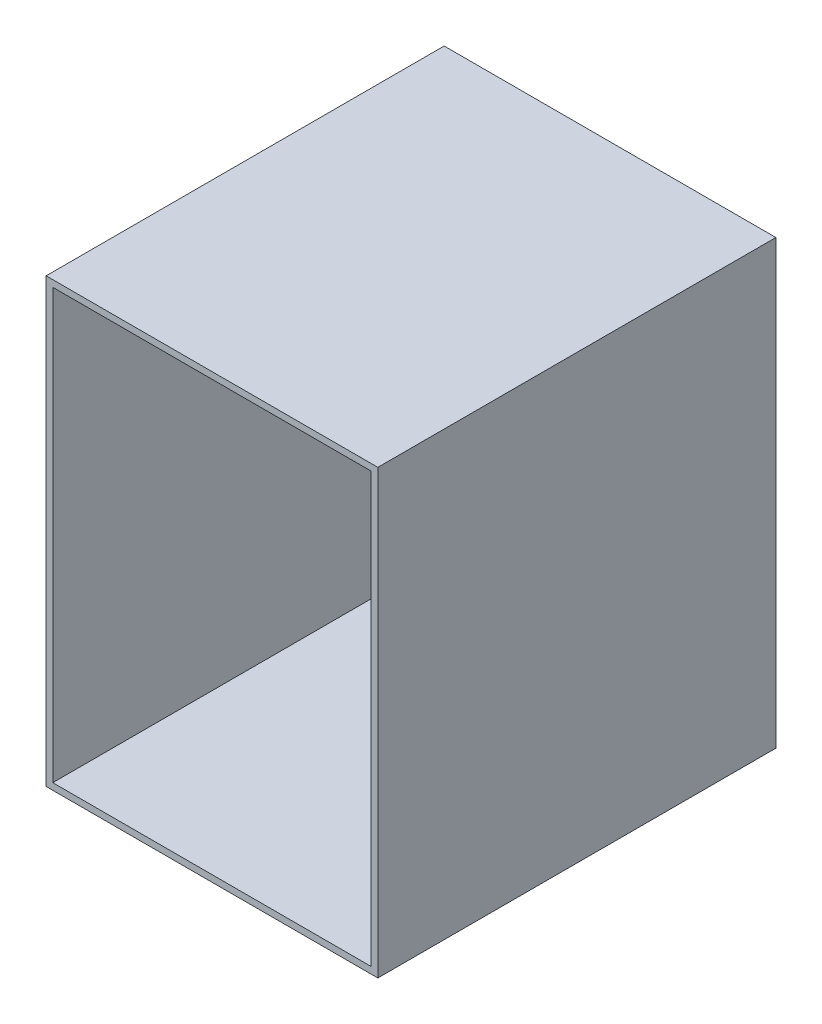
ISO-10303-21;
HEADER;
FILE_DESCRIPTION(('STEP AP214'),'2;1');
FILE_NAME('part.step','',(''),(''),'','','');
FILE_SCHEMA(('AUTOMOTIVE_DESIGN { 1 0 10303 214 1 1 1 1 }'));
ENDSEC;
DATA;
#1=APPLICATION_CONTEXT('core data for automotive mechanical design processes');
#2=APPLICATION_PROTOCOL_DEFINITION('international standard','automotive_design',2000,#1);
#3=PRODUCT_CONTEXT('',#1,'mechanical');
#4=PRODUCT('Part','Part','',(#3));
#5=PRODUCT_RELATED_PRODUCT_CATEGORY('part','',(#4));
#6=PRODUCT_DEFINITION_FORMATION('','',#4);
#7=PRODUCT_DEFINITION_CONTEXT('part definition',#1,'design');
#8=PRODUCT_DEFINITION('design','',#6,#7);
#9=PRODUCT_DEFINITION_SHAPE('','',#8);
#10=(LENGTH_UNIT() NAMED_UNIT(*) SI_UNIT(.MILLI.,.METRE.));
#11=(NAMED_UNIT(*) PLANE_ANGLE_UNIT() SI_UNIT($,.RADIAN.));
#12=(NAMED_UNIT(*) SI_UNIT($,.STERADIAN.) SOLID_ANGLE_UNIT());
#13=UNCERTAINTY_MEASURE_WITH_UNIT(LENGTH_MEASURE(1.E-05),#10,'distance_accuracy_value','');
#14=(GEOMETRIC_REPRESENTATION_CONTEXT(3) GLOBAL_UNCERTAINTY_ASSIGNED_CONTEXT((#13)) GLOBAL_UNIT_ASSIGNED_CONTEXT((#10,
#11,#12)) REPRESENTATION_CONTEXT('',''));
#15=CARTESIAN_POINT('',(0.,0.,0.));
#16=DIRECTION('',(0.,0.,1.));
#17=DIRECTION('',(1.,0.,0.));
#18=AXIS2_PLACEMENT_3D('',#15,#16,#17);
#19=CARTESIAN_POINT('',(-75.,100.,180.));
#20=DIRECTION('',(1.,0.,0.));
#21=DIRECTION('',(0.,1.,0.));
#22=AXIS2_PLACEMENT_3D('',#19,#20,#21);
#23=PLANE('',#22);
#24=DIRECTION('',(0.,-1.,0.));
#25=VECTOR('',#24,1.);
#26=CARTESIAN_POINT('',(-75.,100.,0.));
#27=LINE('',#26,#25);
#28=CARTESIAN_POINT('',(-75.,100.,0.));
#29=VERTEX_POINT('',#28);
#30=CARTESIAN_POINT('',(-75.,-100.,0.));
#31=VERTEX_POINT('',#30);
#32=EDGE_CURVE('E156',#29,#31,#27,.T.);
#33=ORIENTED_EDGE('',*,*,#32,.T.);
#34=DIRECTION('',(0.,0.,-1.));
#35=VECTOR('',#34,1.);
#36=CARTESIAN_POINT('',(-75.,-100.,180.));
#37=LINE('',#36,#35);
#38=CARTESIAN_POINT('',(-75.,-100.,180.));
#39=VERTEX_POINT('',#38);
#40=EDGE_CURVE('E12',#39,#31,#37,.T.);
#41=ORIENTED_EDGE('',*,*,#40,.F.);
#42=DIRECTION('',(0.,-1.,0.));
#43=VECTOR('',#42,1.);
#44=CARTESIAN_POINT('',(-75.,100.,180.));
#45=LINE('',#44,#43);
#46=CARTESIAN_POINT('',(-75.,100.,180.));
#47=VERTEX_POINT('',#46);
#48=EDGE_CURVE('E158',#47,#39,#45,.T.);
#49=ORIENTED_EDGE('',*,*,#48,.F.);
#50=DIRECTION('',(0.,0.,-1.));
#51=VECTOR('',#50,1.);
#52=CARTESIAN_POINT('',(-75.,100.,180.));
#53=LINE('',#52,#51);
#54=EDGE_CURVE('E65',#47,#29,#53,.T.);
#55=ORIENTED_EDGE('',*,*,#54,.T.);
#56=EDGE_LOOP('',(#33,#41,#49,#55));
#57=FACE_BOUND('',#56,.T.);
#58=ADVANCED_FACE('F41',(#57),#23,.F.);
#59=CARTESIAN_POINT('',(-75.,-100.,180.));
#60=DIRECTION('',(0.,1.,0.));
#61=DIRECTION('',(0.,0.,1.));
#62=AXIS2_PLACEMENT_3D('',#59,#60,#61);
#63=PLANE('',#62);
#64=DIRECTION('',(1.,0.,0.));
#65=VECTOR('',#64,1.);
#66=CARTESIAN_POINT('',(-75.,-100.,0.));
#67=LINE('',#66,#65);
#68=CARTESIAN_POINT('',(75.,-100.,0.));
#69=VERTEX_POINT('',#68);
#70=EDGE_CURVE('E173',#31,#69,#67,.T.);
#71=ORIENTED_EDGE('',*,*,#70,.T.);
#72=DIRECTION('',(0.,0.,-1.));
#73=VECTOR('',#72,1.);
#74=CARTESIAN_POINT('',(75.,-100.,180.));
#75=LINE('',#74,#73);
#76=CARTESIAN_POINT('',(75.,-100.,180.));
#77=VERTEX_POINT('',#76);
#78=EDGE_CURVE('E49',#77,#69,#75,.T.);
#79=ORIENTED_EDGE('',*,*,#78,.F.);
#80=DIRECTION('',(1.,0.,0.));
#81=VECTOR('',#80,1.);
#82=CARTESIAN_POINT('',(-75.,-100.,180.));
#83=LINE('',#82,#81);
#84=EDGE_CURVE('E91',#39,#77,#83,.T.);
#85=ORIENTED_EDGE('',*,*,#84,.F.);
#86=ORIENTED_EDGE('',*,*,#40,.T.);
#87=EDGE_LOOP('',(#71,#79,#85,#86));
#88=FACE_BOUND('',#87,.T.);
#89=ADVANCED_FACE('F193',(#88),#63,.F.);
#90=CARTESIAN_POINT('',(75.,100.,180.));
#91=DIRECTION('',(1.,0.,0.));
#92=DIRECTION('',(0.,1.,0.));
#93=AXIS2_PLACEMENT_3D('',#90,#91,#92);
#94=PLANE('',#93);
#95=DIRECTION('',(0.,-1.,0.));
#96=VECTOR('',#95,1.);
#97=CARTESIAN_POINT('',(75.,100.,0.));
#98=LINE('',#97,#96);
#99=CARTESIAN_POINT('',(75.,100.,0.));
#100=VERTEX_POINT('',#99);
#101=EDGE_CURVE('E177',#100,#69,#98,.T.);
#102=ORIENTED_EDGE('',*,*,#101,.F.);
#103=DIRECTION('',(0.,0.,-1.));
#104=VECTOR('',#103,1.);
#105=CARTESIAN_POINT('',(75.,100.,180.));
#106=LINE('',#105,#104);
#107=CARTESIAN_POINT('',(75.,100.,180.));
#108=VERTEX_POINT('',#107);
#109=EDGE_CURVE('E186',#108,#100,#106,.T.);
#110=ORIENTED_EDGE('',*,*,#109,.F.);
#111=DIRECTION('',(0.,-1.,0.));
#112=VECTOR('',#111,1.);
#113=CARTESIAN_POINT('',(75.,100.,180.));
#114=LINE('',#113,#112);
#115=EDGE_CURVE('E164',#108,#77,#114,.T.);
#116=ORIENTED_EDGE('',*,*,#115,.T.);
#117=ORIENTED_EDGE('',*,*,#78,.T.);
#118=EDGE_LOOP('',(#102,#110,#116,#117));
#119=FACE_BOUND('',#118,.T.);
#120=ADVANCED_FACE('F191',(#119),#94,.T.);
#121=CARTESIAN_POINT('',(-75.,100.,180.));
#122=DIRECTION('',(0.,1.,0.));
#123=DIRECTION('',(0.,0.,1.));
#124=AXIS2_PLACEMENT_3D('',#121,#122,#123);
#125=PLANE('',#124);
#126=DIRECTION('',(1.,0.,0.));
#127=VECTOR('',#126,1.);
#128=CARTESIAN_POINT('',(-75.,100.,0.));
#129=LINE('',#128,#127);
#130=EDGE_CURVE('E161',#29,#100,#129,.T.);
#131=ORIENTED_EDGE('',*,*,#130,.F.);
#132=ORIENTED_EDGE('',*,*,#54,.F.);
#133=DIRECTION('',(1.,0.,0.));
#134=VECTOR('',#133,1.);
#135=CARTESIAN_POINT('',(-75.,100.,180.));
#136=LINE('',#135,#134);
#137=EDGE_CURVE('E168',#47,#108,#136,.T.);
#138=ORIENTED_EDGE('',*,*,#137,.T.);
#139=ORIENTED_EDGE('',*,*,#109,.T.);
#140=EDGE_LOOP('',(#131,#132,#138,#139));
#141=FACE_BOUND('',#140,.T.);
#142=ADVANCED_FACE('F197',(#141),#125,.T.);
#143=CARTESIAN_POINT('',(0.,0.,180.));
#144=DIRECTION('',(0.,0.,1.));
#145=DIRECTION('',(1.,0.,0.));
#146=AXIS2_PLACEMENT_3D('',#143,#144,#145);
#147=PLANE('',#146);
#148=DIRECTION('',(0.,1.,0.));
#149=VECTOR('',#148,1.);
#150=CARTESIAN_POINT('',(72.,97.,180.));
#151=LINE('',#150,#149);
#152=CARTESIAN_POINT('',(72.,-97.,180.));
#153=VERTEX_POINT('',#152);
#154=CARTESIAN_POINT('',(72.,97.,180.));
#155=VERTEX_POINT('',#154);
#156=EDGE_CURVE('E56',#153,#155,#151,.T.);
#157=ORIENTED_EDGE('',*,*,#156,.F.);
#158=DIRECTION('',(1.,0.,0.));
#159=VECTOR('',#158,1.);
#160=CARTESIAN_POINT('',(-72.,-97.,180.));
#161=LINE('',#160,#159);
#162=CARTESIAN_POINT('',(-72.,-97.,180.));
#163=VERTEX_POINT('',#162);
#164=EDGE_CURVE('E139',#163,#153,#161,.T.);
#165=ORIENTED_EDGE('',*,*,#164,.F.);
#166=DIRECTION('',(0.,-1.,0.));
#167=VECTOR('',#166,1.);
#168=CARTESIAN_POINT('',(-72.,97.,180.));
#169=LINE('',#168,#167);
#170=CARTESIAN_POINT('',(-72.,97.,180.));
#171=VERTEX_POINT('',#170);
#172=EDGE_CURVE('E120',#171,#163,#169,.T.);
#173=ORIENTED_EDGE('',*,*,#172,.F.);
#174=DIRECTION('',(-1.,0.,0.));
#175=VECTOR('',#174,1.);
#176=CARTESIAN_POINT('',(-72.,97.,180.));
#177=LINE('',#176,#175);
#178=EDGE_CURVE('E131',#155,#171,#177,.T.);
#179=ORIENTED_EDGE('',*,*,#178,.F.);
#180=EDGE_LOOP('',(#157,#165,#173,#179));
#181=FACE_BOUND('',#180,.T.);
#182=ORIENTED_EDGE('',*,*,#48,.T.);
#183=ORIENTED_EDGE('',*,*,#84,.T.);
#184=ORIENTED_EDGE('',*,*,#115,.F.);
#185=ORIENTED_EDGE('',*,*,#137,.F.);
#186=EDGE_LOOP('',(#182,#183,#184,#185));
#187=FACE_BOUND('',#186,.T.);
#188=ADVANCED_FACE('F136',(#181,#187),#147,.T.);
#189=CARTESIAN_POINT('',(0.,0.,0.));
#190=DIRECTION('',(0.,0.,1.));
#191=DIRECTION('',(1.,0.,0.));
#192=AXIS2_PLACEMENT_3D('',#189,#190,#191);
#193=PLANE('',#192);
#194=ORIENTED_EDGE('',*,*,#32,.F.);
#195=ORIENTED_EDGE('',*,*,#130,.T.);
#196=ORIENTED_EDGE('',*,*,#101,.T.);
#197=ORIENTED_EDGE('',*,*,#70,.F.);
#198=EDGE_LOOP('',(#194,#195,#196,#197));
#199=FACE_BOUND('',#198,.T.);
#200=ADVANCED_FACE('F196',(#199),#193,.F.);
#201=CARTESIAN_POINT('',(72.,97.,-241.602980114071));
#202=DIRECTION('',(1.,0.,0.));
#203=DIRECTION('',(0.,1.,0.));
#204=AXIS2_PLACEMENT_3D('',#201,#202,#203);
#205=PLANE('',#204);
#206=DIRECTION('',(0.,-1.,0.));
#207=VECTOR('',#206,1.);
#208=CARTESIAN_POINT('',(72.,97.,5.));
#209=LINE('',#208,#207);
#210=CARTESIAN_POINT('',(72.,97.,5.));
#211=VERTEX_POINT('',#210);
#212=CARTESIAN_POINT('',(72.,-97.,5.));
#213=VERTEX_POINT('',#212);
#214=EDGE_CURVE('E157',#211,#213,#209,.T.);
#215=ORIENTED_EDGE('',*,*,#214,.T.);
#216=DIRECTION('',(0.,0.,1.));
#217=VECTOR('',#216,1.);
#218=CARTESIAN_POINT('',(72.,-97.,-241.602980114071));
#219=LINE('',#218,#217);
#220=EDGE_CURVE('E146',#213,#153,#219,.T.);
#221=ORIENTED_EDGE('',*,*,#220,.T.);
#222=ORIENTED_EDGE('',*,*,#156,.T.);
#223=DIRECTION('',(0.,0.,1.));
#224=VECTOR('',#223,1.);
#225=CARTESIAN_POINT('',(72.,97.,-241.602980114071));
#226=LINE('',#225,#224);
#227=EDGE_CURVE('E128',#211,#155,#226,.T.);
#228=ORIENTED_EDGE('',*,*,#227,.F.);
#229=EDGE_LOOP('',(#215,#221,#222,#228));
#230=FACE_BOUND('',#229,.T.);
#231=ADVANCED_FACE('F212',(#230),#205,.F.);
#232=CARTESIAN_POINT('',(-72.,-97.,-241.602980114071));
#233=DIRECTION('',(0.,-1.,0.));
#234=DIRECTION('',(0.,0.,-1.));
#235=AXIS2_PLACEMENT_3D('',#232,#233,#234);
#236=PLANE('',#235);
#237=DIRECTION('',(-1.,0.,0.));
#238=VECTOR('',#237,1.);
#239=CARTESIAN_POINT('',(-72.,-97.,5.));
#240=LINE('',#239,#238);
#241=CARTESIAN_POINT('',(-72.,-97.,5.));
#242=VERTEX_POINT('',#241);
#243=EDGE_CURVE('E232',#213,#242,#240,.T.);
#244=ORIENTED_EDGE('',*,*,#243,.T.);
#245=DIRECTION('',(0.,0.,1.));
#246=VECTOR('',#245,1.);
#247=CARTESIAN_POINT('',(-72.,-97.,-241.602980114071));
#248=LINE('',#247,#246);
#249=EDGE_CURVE('E127',#242,#163,#248,.T.);
#250=ORIENTED_EDGE('',*,*,#249,.T.);
#251=ORIENTED_EDGE('',*,*,#164,.T.);
#252=ORIENTED_EDGE('',*,*,#220,.F.);
#253=EDGE_LOOP('',(#244,#250,#251,#252));
#254=FACE_BOUND('',#253,.T.);
#255=ADVANCED_FACE('F217',(#254),#236,.F.);
#256=CARTESIAN_POINT('',(-72.,97.,-241.602980114071));
#257=DIRECTION('',(-1.,0.,0.));
#258=DIRECTION('',(0.,-1.,0.));
#259=AXIS2_PLACEMENT_3D('',#256,#257,#258);
#260=PLANE('',#259);
#261=DIRECTION('',(0.,1.,0.));
#262=VECTOR('',#261,1.);
#263=CARTESIAN_POINT('',(-72.,97.,5.));
#264=LINE('',#263,#262);
#265=CARTESIAN_POINT('',(-72.,97.,5.));
#266=VERTEX_POINT('',#265);
#267=EDGE_CURVE('E123',#242,#266,#264,.T.);
#268=ORIENTED_EDGE('',*,*,#267,.T.);
#269=DIRECTION('',(0.,0.,1.));
#270=VECTOR('',#269,1.);
#271=CARTESIAN_POINT('',(-72.,97.,-241.602980114071));
#272=LINE('',#271,#270);
#273=EDGE_CURVE('E115',#266,#171,#272,.T.);
#274=ORIENTED_EDGE('',*,*,#273,.T.);
#275=ORIENTED_EDGE('',*,*,#172,.T.);
#276=ORIENTED_EDGE('',*,*,#249,.F.);
#277=EDGE_LOOP('',(#268,#274,#275,#276));
#278=FACE_BOUND('',#277,.T.);
#279=ADVANCED_FACE('F117',(#278),#260,.F.);
#280=CARTESIAN_POINT('',(-72.,97.,-241.602980114071));
#281=DIRECTION('',(0.,1.,0.));
#282=DIRECTION('',(0.,0.,1.));
#283=AXIS2_PLACEMENT_3D('',#280,#281,#282);
#284=PLANE('',#283);
#285=DIRECTION('',(1.,0.,0.));
#286=VECTOR('',#285,1.);
#287=CARTESIAN_POINT('',(-72.,97.,5.));
#288=LINE('',#287,#286);
#289=EDGE_CURVE('E153',#266,#211,#288,.T.);
#290=ORIENTED_EDGE('',*,*,#289,.T.);
#291=ORIENTED_EDGE('',*,*,#227,.T.);
#292=ORIENTED_EDGE('',*,*,#178,.T.);
#293=ORIENTED_EDGE('',*,*,#273,.F.);
#294=EDGE_LOOP('',(#290,#291,#292,#293));
#295=FACE_BOUND('',#294,.T.);
#296=ADVANCED_FACE('F132',(#295),#284,.F.);
#297=CARTESIAN_POINT('',(0.,0.,5.));
#298=DIRECTION('',(0.,0.,1.));
#299=DIRECTION('',(1.,0.,0.));
#300=AXIS2_PLACEMENT_3D('',#297,#298,#299);
#301=PLANE('',#300);
#302=ORIENTED_EDGE('',*,*,#214,.F.);
#303=ORIENTED_EDGE('',*,*,#289,.F.);
#304=ORIENTED_EDGE('',*,*,#267,.F.);
#305=ORIENTED_EDGE('',*,*,#243,.F.);
#306=EDGE_LOOP('',(#302,#303,#304,#305));
#307=FACE_BOUND('',#306,.T.);
#308=ADVANCED_FACE('F220',(#307),#301,.T.);
#309=CLOSED_SHELL('',(#58,#89,#120,#142,#188,#200,#231,#255,#279,#296,#308));
#310=MANIFOLD_SOLID_BREP('B2',#309);
#311=ADVANCED_BREP_SHAPE_REPRESENTATION('',(#18,#310),#14);
#312=SHAPE_DEFINITION_REPRESENTATION(#9,#311);
ENDSEC;
END-ISO-10303-21;
